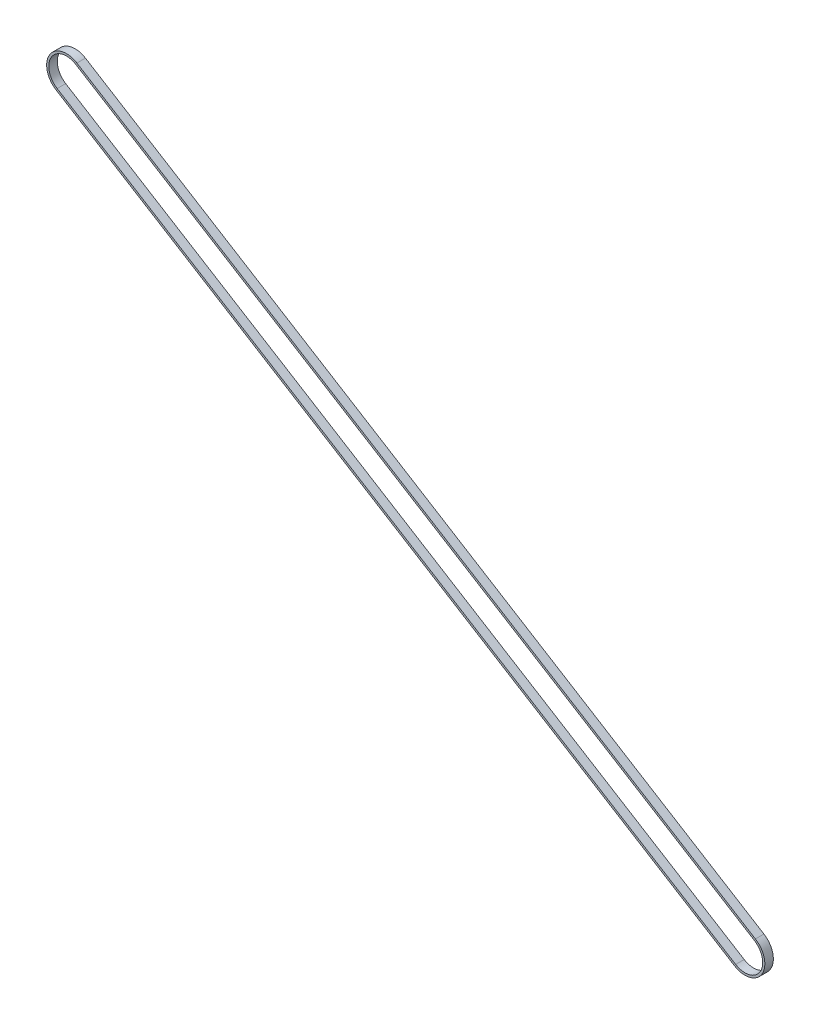
ISO-10303-21;
HEADER;
FILE_DESCRIPTION(('STEP AP214'),'2;1');
FILE_NAME('part.step','',(''),(''),'','','');
FILE_SCHEMA(('AUTOMOTIVE_DESIGN { 1 0 10303 214 1 1 1 1 }'));
ENDSEC;
DATA;
#1=APPLICATION_CONTEXT('core data for automotive mechanical design processes');
#2=APPLICATION_PROTOCOL_DEFINITION('international standard','automotive_design',2000,#1);
#3=PRODUCT_CONTEXT('',#1,'mechanical');
#4=PRODUCT('Part','Part','',(#3));
#5=PRODUCT_RELATED_PRODUCT_CATEGORY('part','',(#4));
#6=PRODUCT_DEFINITION_FORMATION('','',#4);
#7=PRODUCT_DEFINITION_CONTEXT('part definition',#1,'design');
#8=PRODUCT_DEFINITION('design','',#6,#7);
#9=PRODUCT_DEFINITION_SHAPE('','',#8);
#10=(LENGTH_UNIT() NAMED_UNIT(*) SI_UNIT(.MILLI.,.METRE.));
#11=(NAMED_UNIT(*) PLANE_ANGLE_UNIT() SI_UNIT($,.RADIAN.));
#12=(NAMED_UNIT(*) SI_UNIT($,.STERADIAN.) SOLID_ANGLE_UNIT());
#13=UNCERTAINTY_MEASURE_WITH_UNIT(LENGTH_MEASURE(1.E-05),#10,'distance_accuracy_value','');
#14=(GEOMETRIC_REPRESENTATION_CONTEXT(3) GLOBAL_UNCERTAINTY_ASSIGNED_CONTEXT((#13)) GLOBAL_UNIT_ASSIGNED_CONTEXT((#10,
#11,#12)) REPRESENTATION_CONTEXT('',''));
#15=CARTESIAN_POINT('',(0.,0.,0.));
#16=DIRECTION('',(0.,0.,1.));
#17=DIRECTION('',(1.,0.,0.));
#18=AXIS2_PLACEMENT_3D('',#15,#16,#17);
#19=CARTESIAN_POINT('',(-1.82520665248376E-09,-2.9549418467667E-09,6.));
#20=DIRECTION('',(0.,0.,-1.));
#21=DIRECTION('',(-1.,0.,0.));
#22=AXIS2_PLACEMENT_3D('',#19,#20,#21);
#23=PLANE('',#22);
#24=CARTESIAN_POINT('',(-1.82520665248376E-09,-2.9549418467667E-09,6.));
#25=DIRECTION('',(0.,0.,-1.));
#26=DIRECTION('',(-1.,0.,0.));
#27=AXIS2_PLACEMENT_3D('',#24,#25,#26);
#28=CIRCLE('',#27,13.975);
#29=CARTESIAN_POINT('',(-7.34681976853011,-11.8880134751695,6.));
#30=VERTEX_POINT('',#29);
#31=CARTESIAN_POINT('',(7.34681976487978,11.8880134692596,6.));
#32=VERTEX_POINT('',#31);
#33=EDGE_CURVE('E160',#30,#32,#28,.F.);
#34=ORIENTED_EDGE('',*,*,#33,.T.);
#35=DIRECTION('',(-0.850662860265798,0.525711611213231,0.));
#36=VECTOR('',#35,1.);
#37=CARTESIAN_POINT('',(7.34681976487969,11.8880134692596,6.));
#38=LINE('',#37,#36);
#39=CARTESIAN_POINT('',(-470.572588547736,307.243310978774,6.));
#40=VERTEX_POINT('',#39);
#41=EDGE_CURVE('E163',#32,#40,#38,.T.);
#42=ORIENTED_EDGE('',*,*,#41,.T.);
#43=CARTESIAN_POINT('',(-477.91940831444,295.355297506559,6.));
#44=DIRECTION('',(0.,0.,-1.));
#45=DIRECTION('',(-1.,0.,0.));
#46=AXIS2_PLACEMENT_3D('',#43,#44,#45);
#47=CIRCLE('',#46,13.975);
#48=CARTESIAN_POINT('',(-485.266228081145,283.467284034345,6.));
#49=VERTEX_POINT('',#48);
#50=EDGE_CURVE('E166',#40,#49,#47,.F.);
#51=ORIENTED_EDGE('',*,*,#50,.T.);
#52=DIRECTION('',(0.850662860265798,-0.525711611213231,0.));
#53=VECTOR('',#52,1.);
#54=CARTESIAN_POINT('',(-7.34681976853012,-11.8880134751695,6.));
#55=LINE('',#54,#53);
#56=EDGE_CURVE('E168',#49,#30,#55,.T.);
#57=ORIENTED_EDGE('',*,*,#56,.T.);
#58=EDGE_LOOP('',(#34,#42,#51,#57));
#59=FACE_BOUND('',#58,.T.);
#60=CARTESIAN_POINT('',(-1.82520665248376E-09,-2.9549418467667E-09,6.));
#61=DIRECTION('',(0.,0.,1.));
#62=DIRECTION('',(-1.,0.,0.));
#63=AXIS2_PLACEMENT_3D('',#60,#61,#62);
#64=CIRCLE('',#63,12.475);
#65=CARTESIAN_POINT('',(-6.55825235171027,-10.6120191847708,6.));
#66=VERTEX_POINT('',#65);
#67=CARTESIAN_POINT('',(6.55825234805985,10.6120191788609,6.));
#68=VERTEX_POINT('',#67);
#69=EDGE_CURVE('E124',#66,#68,#64,.T.);
#70=ORIENTED_EDGE('',*,*,#69,.F.);
#71=DIRECTION('',(0.850662860265798,-0.525711611213231,0.));
#72=VECTOR('',#71,1.);
#73=CARTESIAN_POINT('',(-6.55825235171027,-10.6120191847708,6.));
#74=LINE('',#73,#72);
#75=CARTESIAN_POINT('',(-484.477660664326,284.743278324744,6.));
#76=VERTEX_POINT('',#75);
#77=EDGE_CURVE('E146',#76,#66,#74,.T.);
#78=ORIENTED_EDGE('',*,*,#77,.F.);
#79=CARTESIAN_POINT('',(-477.91940831444,295.355297506559,6.));
#80=DIRECTION('',(0.,0.,1.));
#81=DIRECTION('',(-1.,0.,0.));
#82=AXIS2_PLACEMENT_3D('',#79,#80,#81);
#83=CIRCLE('',#82,12.475);
#84=CARTESIAN_POINT('',(-471.361155964555,305.967316688375,6.));
#85=VERTEX_POINT('',#84);
#86=EDGE_CURVE('E144',#85,#76,#83,.T.);
#87=ORIENTED_EDGE('',*,*,#86,.F.);
#88=DIRECTION('',(-0.850662860265798,0.525711611213231,0.));
#89=VECTOR('',#88,1.);
#90=CARTESIAN_POINT('',(-471.361155964555,305.967316688375,6.));
#91=LINE('',#90,#89);
#92=EDGE_CURVE('E132',#68,#85,#91,.T.);
#93=ORIENTED_EDGE('',*,*,#92,.F.);
#94=EDGE_LOOP('',(#70,#78,#87,#93));
#95=FACE_BOUND('',#94,.T.);
#96=ADVANCED_FACE('F59',(#59,#95),#23,.F.);
#97=CARTESIAN_POINT('',(-1.82520665248376E-09,-2.9549418467667E-09,0.));
#98=DIRECTION('',(0.,0.,-1.));
#99=DIRECTION('',(-1.,0.,0.));
#100=AXIS2_PLACEMENT_3D('',#97,#98,#99);
#101=PLANE('',#100);
#102=CARTESIAN_POINT('',(-1.82520665248376E-09,-2.9549418467667E-09,0.));
#103=DIRECTION('',(0.,0.,-1.));
#104=DIRECTION('',(-1.,0.,0.));
#105=AXIS2_PLACEMENT_3D('',#102,#103,#104);
#106=CIRCLE('',#105,13.975);
#107=CARTESIAN_POINT('',(-7.34681976853011,-11.8880134751695,0.));
#108=VERTEX_POINT('',#107);
#109=CARTESIAN_POINT('',(7.34681976487978,11.8880134692596,0.));
#110=VERTEX_POINT('',#109);
#111=EDGE_CURVE('E140',#108,#110,#106,.F.);
#112=ORIENTED_EDGE('',*,*,#111,.F.);
#113=DIRECTION('',(0.850662860265798,-0.525711611213231,0.));
#114=VECTOR('',#113,1.);
#115=CARTESIAN_POINT('',(-7.34681976853012,-11.8880134751695,0.));
#116=LINE('',#115,#114);
#117=CARTESIAN_POINT('',(-485.266228081145,283.467284034345,0.));
#118=VERTEX_POINT('',#117);
#119=EDGE_CURVE('E164',#118,#108,#116,.T.);
#120=ORIENTED_EDGE('',*,*,#119,.F.);
#121=CARTESIAN_POINT('',(-477.91940831444,295.355297506559,0.));
#122=DIRECTION('',(0.,0.,-1.));
#123=DIRECTION('',(-1.,0.,0.));
#124=AXIS2_PLACEMENT_3D('',#121,#122,#123);
#125=CIRCLE('',#124,13.975);
#126=CARTESIAN_POINT('',(-470.572588547736,307.243310978774,0.));
#127=VERTEX_POINT('',#126);
#128=EDGE_CURVE('E175',#127,#118,#125,.F.);
#129=ORIENTED_EDGE('',*,*,#128,.F.);
#130=DIRECTION('',(-0.850662860265798,0.525711611213231,0.));
#131=VECTOR('',#130,1.);
#132=CARTESIAN_POINT('',(7.34681976487969,11.8880134692596,0.));
#133=LINE('',#132,#131);
#134=EDGE_CURVE('E173',#110,#127,#133,.T.);
#135=ORIENTED_EDGE('',*,*,#134,.F.);
#136=EDGE_LOOP('',(#112,#120,#129,#135));
#137=FACE_BOUND('',#136,.T.);
#138=DIRECTION('',(0.850662860265798,-0.525711611213231,0.));
#139=VECTOR('',#138,1.);
#140=CARTESIAN_POINT('',(-6.55825235171027,-10.6120191847708,0.));
#141=LINE('',#140,#139);
#142=CARTESIAN_POINT('',(-484.477660664326,284.743278324743,0.));
#143=VERTEX_POINT('',#142);
#144=CARTESIAN_POINT('',(-6.55825235171027,-10.6120191847708,0.));
#145=VERTEX_POINT('',#144);
#146=EDGE_CURVE('E133',#143,#145,#141,.T.);
#147=ORIENTED_EDGE('',*,*,#146,.T.);
#148=CARTESIAN_POINT('',(-1.82520665248376E-09,-2.9549418467667E-09,0.));
#149=DIRECTION('',(0.,0.,1.));
#150=DIRECTION('',(-1.,0.,0.));
#151=AXIS2_PLACEMENT_3D('',#148,#149,#150);
#152=CIRCLE('',#151,12.475);
#153=CARTESIAN_POINT('',(6.55825234805985,10.6120191788609,0.));
#154=VERTEX_POINT('',#153);
#155=EDGE_CURVE('E82',#145,#154,#152,.T.);
#156=ORIENTED_EDGE('',*,*,#155,.T.);
#157=DIRECTION('',(-0.850662860265798,0.525711611213231,0.));
#158=VECTOR('',#157,1.);
#159=CARTESIAN_POINT('',(-471.361155964555,305.967316688375,0.));
#160=LINE('',#159,#158);
#161=CARTESIAN_POINT('',(-471.361155964555,305.967316688375,0.));
#162=VERTEX_POINT('',#161);
#163=EDGE_CURVE('E139',#154,#162,#160,.T.);
#164=ORIENTED_EDGE('',*,*,#163,.T.);
#165=CARTESIAN_POINT('',(-477.91940831444,295.355297506559,0.));
#166=DIRECTION('',(0.,0.,1.));
#167=DIRECTION('',(-1.,0.,0.));
#168=AXIS2_PLACEMENT_3D('',#165,#166,#167);
#169=CIRCLE('',#168,12.475);
#170=EDGE_CURVE('E152',#162,#143,#169,.T.);
#171=ORIENTED_EDGE('',*,*,#170,.T.);
#172=EDGE_LOOP('',(#147,#156,#164,#171));
#173=FACE_BOUND('',#172,.T.);
#174=ADVANCED_FACE('F193',(#137,#173),#101,.T.);
#175=CARTESIAN_POINT('',(-1.82520665248376E-09,-2.9549418467667E-09,6.));
#176=DIRECTION('',(0.,0.,-1.));
#177=DIRECTION('',(-1.,0.,0.));
#178=AXIS2_PLACEMENT_3D('',#175,#176,#177);
#179=CYLINDRICAL_SURFACE('',#178,13.975);
#180=ORIENTED_EDGE('',*,*,#111,.T.);
#181=DIRECTION('',(0.,0.,-1.));
#182=VECTOR('',#181,1.);
#183=CARTESIAN_POINT('',(7.34681976487978,11.8880134692596,6.));
#184=LINE('',#183,#182);
#185=EDGE_CURVE('E12',#32,#110,#184,.T.);
#186=ORIENTED_EDGE('',*,*,#185,.F.);
#187=ORIENTED_EDGE('',*,*,#33,.F.);
#188=DIRECTION('',(0.,0.,-1.));
#189=VECTOR('',#188,1.);
#190=CARTESIAN_POINT('',(-7.34681976853011,-11.8880134751695,6.));
#191=LINE('',#190,#189);
#192=EDGE_CURVE('E170',#30,#108,#191,.T.);
#193=ORIENTED_EDGE('',*,*,#192,.T.);
#194=EDGE_LOOP('',(#180,#186,#187,#193));
#195=FACE_BOUND('',#194,.T.);
#196=ADVANCED_FACE('F61',(#195),#179,.T.);
#197=CARTESIAN_POINT('',(7.34681976487969,11.8880134692596,6.));
#198=DIRECTION('',(-0.525711611213231,-0.850662860265798,0.));
#199=DIRECTION('',(0.850662860265798,-0.525711611213231,0.));
#200=AXIS2_PLACEMENT_3D('',#197,#198,#199);
#201=PLANE('',#200);
#202=ORIENTED_EDGE('',*,*,#134,.T.);
#203=DIRECTION('',(0.,0.,-1.));
#204=VECTOR('',#203,1.);
#205=CARTESIAN_POINT('',(-470.572588547736,307.243310978774,6.));
#206=LINE('',#205,#204);
#207=EDGE_CURVE('E67',#40,#127,#206,.T.);
#208=ORIENTED_EDGE('',*,*,#207,.F.);
#209=ORIENTED_EDGE('',*,*,#41,.F.);
#210=ORIENTED_EDGE('',*,*,#185,.T.);
#211=EDGE_LOOP('',(#202,#208,#209,#210));
#212=FACE_BOUND('',#211,.T.);
#213=ADVANCED_FACE('F203',(#212),#201,.F.);
#214=CARTESIAN_POINT('',(-477.91940831444,295.355297506559,6.));
#215=DIRECTION('',(0.,0.,-1.));
#216=DIRECTION('',(-1.,0.,0.));
#217=AXIS2_PLACEMENT_3D('',#214,#215,#216);
#218=CYLINDRICAL_SURFACE('',#217,13.975);
#219=ORIENTED_EDGE('',*,*,#128,.T.);
#220=DIRECTION('',(0.,0.,-1.));
#221=VECTOR('',#220,1.);
#222=CARTESIAN_POINT('',(-485.266228081145,283.467284034345,6.));
#223=LINE('',#222,#221);
#224=EDGE_CURVE('E180',#49,#118,#223,.T.);
#225=ORIENTED_EDGE('',*,*,#224,.F.);
#226=ORIENTED_EDGE('',*,*,#50,.F.);
#227=ORIENTED_EDGE('',*,*,#207,.T.);
#228=EDGE_LOOP('',(#219,#225,#226,#227));
#229=FACE_BOUND('',#228,.T.);
#230=ADVANCED_FACE('F187',(#229),#218,.T.);
#231=CARTESIAN_POINT('',(-7.34681976853012,-11.8880134751695,6.));
#232=DIRECTION('',(0.525711611213231,0.850662860265798,0.));
#233=DIRECTION('',(-0.850662860265798,0.525711611213231,0.));
#234=AXIS2_PLACEMENT_3D('',#231,#232,#233);
#235=PLANE('',#234);
#236=ORIENTED_EDGE('',*,*,#119,.T.);
#237=ORIENTED_EDGE('',*,*,#192,.F.);
#238=ORIENTED_EDGE('',*,*,#56,.F.);
#239=ORIENTED_EDGE('',*,*,#224,.T.);
#240=EDGE_LOOP('',(#236,#237,#238,#239));
#241=FACE_BOUND('',#240,.T.);
#242=ADVANCED_FACE('F197',(#241),#235,.F.);
#243=CARTESIAN_POINT('',(-1.82520665248376E-09,-2.9549418467667E-09,6.));
#244=DIRECTION('',(0.,0.,-1.));
#245=DIRECTION('',(-1.,0.,0.));
#246=AXIS2_PLACEMENT_3D('',#243,#244,#245);
#247=CYLINDRICAL_SURFACE('',#246,12.475);
#248=ORIENTED_EDGE('',*,*,#155,.F.);
#249=DIRECTION('',(0.,0.,-1.));
#250=VECTOR('',#249,1.);
#251=CARTESIAN_POINT('',(-6.55825235171027,-10.6120191847708,6.));
#252=LINE('',#251,#250);
#253=EDGE_CURVE('E128',#66,#145,#252,.T.);
#254=ORIENTED_EDGE('',*,*,#253,.F.);
#255=ORIENTED_EDGE('',*,*,#69,.T.);
#256=DIRECTION('',(0.,0.,-1.));
#257=VECTOR('',#256,1.);
#258=CARTESIAN_POINT('',(6.55825234805985,10.6120191788609,6.));
#259=LINE('',#258,#257);
#260=EDGE_CURVE('E127',#68,#154,#259,.T.);
#261=ORIENTED_EDGE('',*,*,#260,.T.);
#262=EDGE_LOOP('',(#248,#254,#255,#261));
#263=FACE_BOUND('',#262,.T.);
#264=ADVANCED_FACE('F126',(#263),#247,.F.);
#265=CARTESIAN_POINT('',(-471.361155964555,305.967316688375,6.));
#266=DIRECTION('',(-0.525711611213231,-0.850662860265798,0.));
#267=DIRECTION('',(0.850662860265798,-0.525711611213231,0.));
#268=AXIS2_PLACEMENT_3D('',#265,#266,#267);
#269=PLANE('',#268);
#270=ORIENTED_EDGE('',*,*,#163,.F.);
#271=ORIENTED_EDGE('',*,*,#260,.F.);
#272=ORIENTED_EDGE('',*,*,#92,.T.);
#273=DIRECTION('',(0.,0.,-1.));
#274=VECTOR('',#273,1.);
#275=CARTESIAN_POINT('',(-471.361155964555,305.967316688375,6.));
#276=LINE('',#275,#274);
#277=EDGE_CURVE('E141',#85,#162,#276,.T.);
#278=ORIENTED_EDGE('',*,*,#277,.T.);
#279=EDGE_LOOP('',(#270,#271,#272,#278));
#280=FACE_BOUND('',#279,.T.);
#281=ADVANCED_FACE('F136',(#280),#269,.T.);
#282=CARTESIAN_POINT('',(-477.91940831444,295.355297506559,6.));
#283=DIRECTION('',(0.,0.,-1.));
#284=DIRECTION('',(-1.,0.,0.));
#285=AXIS2_PLACEMENT_3D('',#282,#283,#284);
#286=CYLINDRICAL_SURFACE('',#285,12.475);
#287=ORIENTED_EDGE('',*,*,#170,.F.);
#288=ORIENTED_EDGE('',*,*,#277,.F.);
#289=ORIENTED_EDGE('',*,*,#86,.T.);
#290=DIRECTION('',(0.,0.,-1.));
#291=VECTOR('',#290,1.);
#292=CARTESIAN_POINT('',(-484.477660664326,284.743278324743,6.));
#293=LINE('',#292,#291);
#294=EDGE_CURVE('E74',#76,#143,#293,.T.);
#295=ORIENTED_EDGE('',*,*,#294,.T.);
#296=EDGE_LOOP('',(#287,#288,#289,#295));
#297=FACE_BOUND('',#296,.T.);
#298=ADVANCED_FACE('F226',(#297),#286,.F.);
#299=CARTESIAN_POINT('',(-6.55825235171027,-10.6120191847708,6.));
#300=DIRECTION('',(0.525711611213231,0.850662860265798,0.));
#301=DIRECTION('',(-0.850662860265798,0.525711611213231,0.));
#302=AXIS2_PLACEMENT_3D('',#299,#300,#301);
#303=PLANE('',#302);
#304=ORIENTED_EDGE('',*,*,#146,.F.);
#305=ORIENTED_EDGE('',*,*,#294,.F.);
#306=ORIENTED_EDGE('',*,*,#77,.T.);
#307=ORIENTED_EDGE('',*,*,#253,.T.);
#308=EDGE_LOOP('',(#304,#305,#306,#307));
#309=FACE_BOUND('',#308,.T.);
#310=ADVANCED_FACE('F230',(#309),#303,.T.);
#311=CLOSED_SHELL('',(#96,#174,#196,#213,#230,#242,#264,#281,#298,#310));
#312=MANIFOLD_SOLID_BREP('B2',#311);
#313=ADVANCED_BREP_SHAPE_REPRESENTATION('',(#18,#312),#14);
#314=SHAPE_DEFINITION_REPRESENTATION(#9,#313);
ENDSEC;
END-ISO-10303-21;
